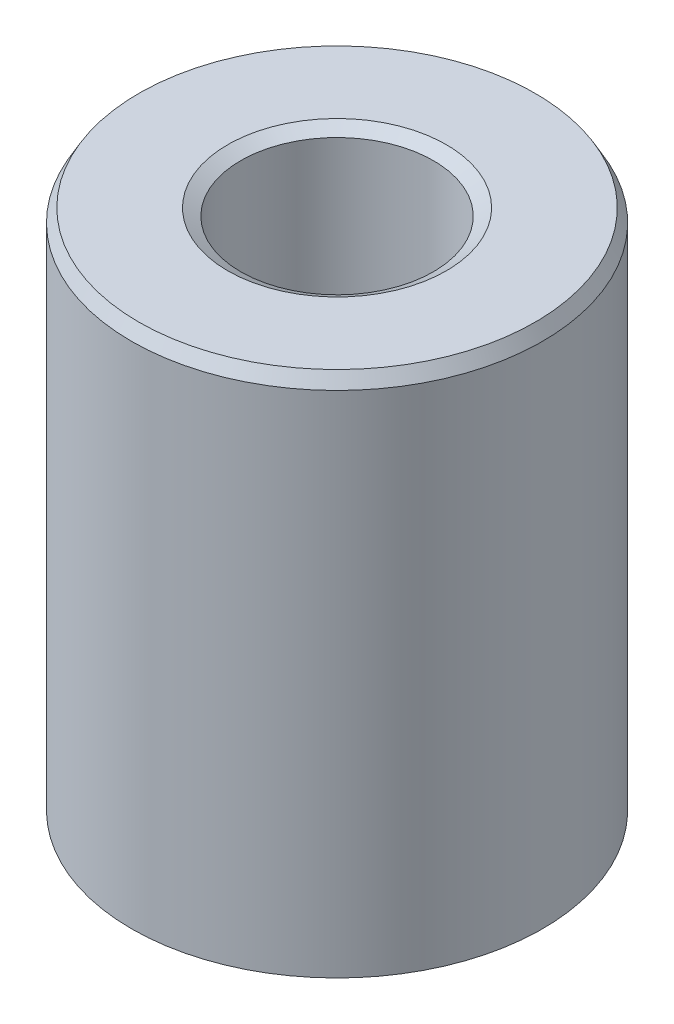
ISO-10303-21;
HEADER;
FILE_DESCRIPTION(('STEP AP214'),'2;1');
FILE_NAME('part.step','',(''),(''),'','','');
FILE_SCHEMA(('AUTOMOTIVE_DESIGN { 1 0 10303 214 1 1 1 1 }'));
ENDSEC;
DATA;
#1=APPLICATION_CONTEXT('core data for automotive mechanical design processes');
#2=APPLICATION_PROTOCOL_DEFINITION('international standard','automotive_design',2000,#1);
#3=PRODUCT_CONTEXT('',#1,'mechanical');
#4=PRODUCT('Part','Part','',(#3));
#5=PRODUCT_RELATED_PRODUCT_CATEGORY('part','',(#4));
#6=PRODUCT_DEFINITION_FORMATION('','',#4);
#7=PRODUCT_DEFINITION_CONTEXT('part definition',#1,'design');
#8=PRODUCT_DEFINITION('design','',#6,#7);
#9=PRODUCT_DEFINITION_SHAPE('','',#8);
#10=(LENGTH_UNIT() NAMED_UNIT(*) SI_UNIT(.MILLI.,.METRE.));
#11=(NAMED_UNIT(*) PLANE_ANGLE_UNIT() SI_UNIT($,.RADIAN.));
#12=(NAMED_UNIT(*) SI_UNIT($,.STERADIAN.) SOLID_ANGLE_UNIT());
#13=UNCERTAINTY_MEASURE_WITH_UNIT(LENGTH_MEASURE(1.E-05),#10,'distance_accuracy_value','');
#14=(GEOMETRIC_REPRESENTATION_CONTEXT(3) GLOBAL_UNCERTAINTY_ASSIGNED_CONTEXT((#13)) GLOBAL_UNIT_ASSIGNED_CONTEXT((#10,
#11,#12)) REPRESENTATION_CONTEXT('',''));
#15=CARTESIAN_POINT('',(0.,0.,0.));
#16=DIRECTION('',(0.,0.,1.));
#17=DIRECTION('',(1.,0.,0.));
#18=AXIS2_PLACEMENT_3D('',#15,#16,#17);
#19=CARTESIAN_POINT('',(0.,25.7474495741322,0.));
#20=DIRECTION('',(0.,-1.,0.));
#21=DIRECTION('',(0.,0.,-1.));
#22=AXIS2_PLACEMENT_3D('',#19,#20,#21);
#23=CYLINDRICAL_SURFACE('',#22,10.);
#24=CARTESIAN_POINT('',(0.,0.355804082203742,0.));
#25=DIRECTION('',(0.,1.,0.));
#26=DIRECTION('',(0.,0.,1.));
#27=AXIS2_PLACEMENT_3D('',#24,#25,#26);
#28=CIRCLE('',#27,10.);
#29=CARTESIAN_POINT('',(0.,0.355804082203742,10.));
#30=VERTEX_POINT('',#29);
#31=EDGE_CURVE('E10',#30,#30,#28,.T.);
#32=ORIENTED_EDGE('',*,*,#31,.T.);
#33=EDGE_LOOP('',(#32));
#34=FACE_BOUND('',#33,.T.);
#35=CARTESIAN_POINT('',(0.,25.1164371334456,0.));
#36=DIRECTION('',(0.,1.,0.));
#37=DIRECTION('',(0.,0.,1.));
#38=AXIS2_PLACEMENT_3D('',#35,#36,#37);
#39=CIRCLE('',#38,10.);
#40=CARTESIAN_POINT('',(0.,25.1164371334456,10.));
#41=VERTEX_POINT('',#40);
#42=EDGE_CURVE('E50',#41,#41,#39,.F.);
#43=ORIENTED_EDGE('',*,*,#42,.T.);
#44=EDGE_LOOP('',(#43));
#45=FACE_BOUND('',#44,.T.);
#46=ADVANCED_FACE('F39',(#34,#45),#23,.T.);
#47=CARTESIAN_POINT('',(0.,25.7474495741322,0.));
#48=DIRECTION('',(0.,1.,0.));
#49=DIRECTION('',(0.,0.,1.));
#50=AXIS2_PLACEMENT_3D('',#47,#48,#49);
#51=PLANE('',#50);
#52=CARTESIAN_POINT('',(0.,25.7474495741322,0.));
#53=DIRECTION('',(0.,1.,0.));
#54=DIRECTION('',(0.,0.,1.));
#55=AXIS2_PLACEMENT_3D('',#52,#53,#54);
#56=CIRCLE('',#55,5.31972578772959);
#57=CARTESIAN_POINT('',(0.,25.7474495741322,5.31972578772959));
#58=VERTEX_POINT('',#57);
#59=EDGE_CURVE('E58',#58,#58,#56,.F.);
#60=ORIENTED_EDGE('',*,*,#59,.T.);
#61=EDGE_LOOP('',(#60));
#62=FACE_BOUND('',#61,.T.);
#63=CARTESIAN_POINT('',(0.,25.7474495741322,0.));
#64=DIRECTION('',(0.,1.,0.));
#65=DIRECTION('',(0.,0.,1.));
#66=AXIS2_PLACEMENT_3D('',#63,#64,#65);
#67=CIRCLE('',#66,9.64419591779626);
#68=CARTESIAN_POINT('',(0.,25.7474495741322,9.64419591779626));
#69=VERTEX_POINT('',#68);
#70=EDGE_CURVE('E61',#69,#69,#67,.T.);
#71=ORIENTED_EDGE('',*,*,#70,.T.);
#72=EDGE_LOOP('',(#71));
#73=FACE_BOUND('',#72,.T.);
#74=ADVANCED_FACE('F88',(#62,#73),#51,.T.);
#75=CARTESIAN_POINT('',(0.,0.,0.));
#76=DIRECTION('',(0.,1.,0.));
#77=DIRECTION('',(0.,0.,1.));
#78=AXIS2_PLACEMENT_3D('',#75,#76,#77);
#79=PLANE('',#78);
#80=CARTESIAN_POINT('',(0.,0.,0.));
#81=DIRECTION('',(0.,1.,0.));
#82=DIRECTION('',(0.,0.,1.));
#83=AXIS2_PLACEMENT_3D('',#80,#81,#82);
#84=CIRCLE('',#83,5.04451742924667);
#85=CARTESIAN_POINT('',(0.,0.,5.04451742924667));
#86=VERTEX_POINT('',#85);
#87=EDGE_CURVE('E51',#86,#86,#84,.T.);
#88=ORIENTED_EDGE('',*,*,#87,.T.);
#89=EDGE_LOOP('',(#88));
#90=FACE_BOUND('',#89,.T.);
#91=CARTESIAN_POINT('',(0.,0.,0.));
#92=DIRECTION('',(0.,1.,0.));
#93=DIRECTION('',(0.,0.,1.));
#94=AXIS2_PLACEMENT_3D('',#91,#92,#93);
#95=CIRCLE('',#94,9.36898755931334);
#96=CARTESIAN_POINT('',(0.,0.,9.36898755931334));
#97=VERTEX_POINT('',#96);
#98=EDGE_CURVE('E54',#97,#97,#95,.F.);
#99=ORIENTED_EDGE('',*,*,#98,.T.);
#100=EDGE_LOOP('',(#99));
#101=FACE_BOUND('',#100,.T.);
#102=ADVANCED_FACE('F83',(#90,#101),#79,.F.);
#103=CARTESIAN_POINT('',(0.,25.7474495741322,0.));
#104=DIRECTION('',(0.,-1.,0.));
#105=DIRECTION('',(0.,0.,-1.));
#106=AXIS2_PLACEMENT_3D('',#103,#104,#105);
#107=CYLINDRICAL_SURFACE('',#106,4.68871334704293);
#108=CARTESIAN_POINT('',(0.,25.3916454919285,0.));
#109=DIRECTION('',(0.,1.,0.));
#110=DIRECTION('',(0.,0.,1.));
#111=AXIS2_PLACEMENT_3D('',#108,#109,#110);
#112=CIRCLE('',#111,4.68871334704293);
#113=CARTESIAN_POINT('',(0.,25.3916454919285,4.68871334704293));
#114=VERTEX_POINT('',#113);
#115=EDGE_CURVE('E67',#114,#114,#112,.T.);
#116=ORIENTED_EDGE('',*,*,#115,.T.);
#117=EDGE_LOOP('',(#116));
#118=FACE_BOUND('',#117,.T.);
#119=CARTESIAN_POINT('',(0.,0.631012440686651,0.));
#120=DIRECTION('',(0.,1.,0.));
#121=DIRECTION('',(0.,0.,1.));
#122=AXIS2_PLACEMENT_3D('',#119,#120,#121);
#123=CIRCLE('',#122,4.68871334704293);
#124=CARTESIAN_POINT('',(0.,0.631012440686651,4.68871334704293));
#125=VERTEX_POINT('',#124);
#126=EDGE_CURVE('E69',#125,#125,#123,.F.);
#127=ORIENTED_EDGE('',*,*,#126,.T.);
#128=EDGE_LOOP('',(#127));
#129=FACE_BOUND('',#128,.T.);
#130=ADVANCED_FACE('F71',(#118,#129),#107,.F.);
#131=CARTESIAN_POINT('',(0.,25.3916454919285,0.));
#132=DIRECTION('',(0.,1.,0.));
#133=DIRECTION('',(0.,0.,1.));
#134=AXIS2_PLACEMENT_3D('',#131,#132,#133);
#135=CONICAL_SURFACE('',#134,4.68871334704293,1.05737265882299);
#136=ORIENTED_EDGE('',*,*,#59,.F.);
#137=EDGE_LOOP('',(#136));
#138=FACE_BOUND('',#137,.T.);
#139=ORIENTED_EDGE('',*,*,#115,.F.);
#140=EDGE_LOOP('',(#139));
#141=FACE_BOUND('',#140,.T.);
#142=ADVANCED_FACE('F77',(#138,#141),#135,.F.);
#143=CARTESIAN_POINT('',(0.,0.,0.));
#144=DIRECTION('',(0.,-1.,0.));
#145=DIRECTION('',(0.,0.,-1.));
#146=AXIS2_PLACEMENT_3D('',#143,#144,#145);
#147=CONICAL_SURFACE('',#146,5.04451742924667,0.51342366797191);
#148=ORIENTED_EDGE('',*,*,#126,.F.);
#149=EDGE_LOOP('',(#148));
#150=FACE_BOUND('',#149,.T.);
#151=ORIENTED_EDGE('',*,*,#87,.F.);
#152=EDGE_LOOP('',(#151));
#153=FACE_BOUND('',#152,.T.);
#154=ADVANCED_FACE('F73',(#150,#153),#147,.F.);
#155=CARTESIAN_POINT('',(0.,0.355804082203742,0.));
#156=DIRECTION('',(0.,1.,0.));
#157=DIRECTION('',(0.,0.,1.));
#158=AXIS2_PLACEMENT_3D('',#155,#156,#157);
#159=CONICAL_SURFACE('',#158,10.,1.05737265882299);
#160=ORIENTED_EDGE('',*,*,#98,.F.);
#161=EDGE_LOOP('',(#160));
#162=FACE_BOUND('',#161,.T.);
#163=ORIENTED_EDGE('',*,*,#31,.F.);
#164=EDGE_LOOP('',(#163));
#165=FACE_BOUND('',#164,.T.);
#166=ADVANCED_FACE('F76',(#162,#165),#159,.T.);
#167=CARTESIAN_POINT('',(0.,25.7474495741322,0.));
#168=DIRECTION('',(0.,-1.,0.));
#169=DIRECTION('',(0.,0.,-1.));
#170=AXIS2_PLACEMENT_3D('',#167,#168,#169);
#171=CONICAL_SURFACE('',#170,9.64419591779626,0.513423667971913);
#172=ORIENTED_EDGE('',*,*,#42,.F.);
#173=EDGE_LOOP('',(#172));
#174=FACE_BOUND('',#173,.T.);
#175=ORIENTED_EDGE('',*,*,#70,.F.);
#176=EDGE_LOOP('',(#175));
#177=FACE_BOUND('',#176,.T.);
#178=ADVANCED_FACE('F45',(#174,#177),#171,.T.);
#179=CLOSED_SHELL('',(#46,#74,#102,#130,#142,#154,#166,#178));
#180=MANIFOLD_SOLID_BREP('B2',#179);
#181=ADVANCED_BREP_SHAPE_REPRESENTATION('',(#18,#180),#14);
#182=SHAPE_DEFINITION_REPRESENTATION(#9,#181);
ENDSEC;
END-ISO-10303-21;
